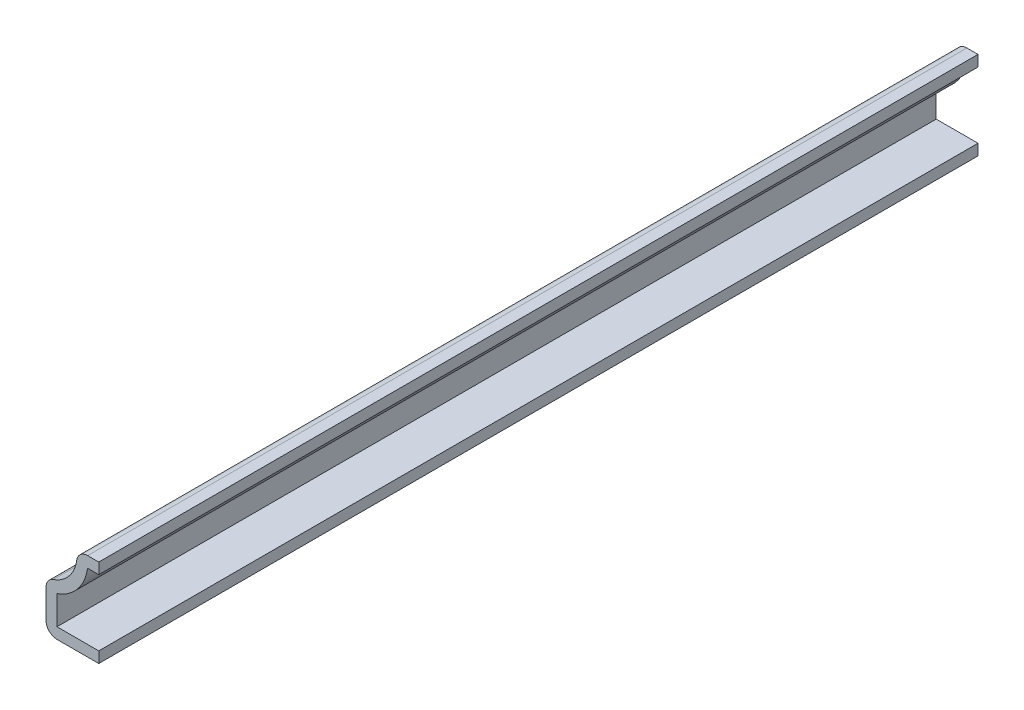
ISO-10303-21;
HEADER;
FILE_DESCRIPTION(('STEP AP214'),'2;1');
FILE_NAME('part.step','',(''),(''),'','','');
FILE_SCHEMA(('AUTOMOTIVE_DESIGN { 1 0 10303 214 1 1 1 1 }'));
ENDSEC;
DATA;
#1=APPLICATION_CONTEXT('core data for automotive mechanical design processes');
#2=APPLICATION_PROTOCOL_DEFINITION('international standard','automotive_design',2000,#1);
#3=PRODUCT_CONTEXT('',#1,'mechanical');
#4=PRODUCT('Part','Part','',(#3));
#5=PRODUCT_RELATED_PRODUCT_CATEGORY('part','',(#4));
#6=PRODUCT_DEFINITION_FORMATION('','',#4);
#7=PRODUCT_DEFINITION_CONTEXT('part definition',#1,'design');
#8=PRODUCT_DEFINITION('design','',#6,#7);
#9=PRODUCT_DEFINITION_SHAPE('','',#8);
#10=(LENGTH_UNIT() NAMED_UNIT(*) SI_UNIT(.MILLI.,.METRE.));
#11=(NAMED_UNIT(*) PLANE_ANGLE_UNIT() SI_UNIT($,.RADIAN.));
#12=(NAMED_UNIT(*) SI_UNIT($,.STERADIAN.) SOLID_ANGLE_UNIT());
#13=UNCERTAINTY_MEASURE_WITH_UNIT(LENGTH_MEASURE(1.E-05),#10,'distance_accuracy_value','');
#14=(GEOMETRIC_REPRESENTATION_CONTEXT(3) GLOBAL_UNCERTAINTY_ASSIGNED_CONTEXT((#13)) GLOBAL_UNIT_ASSIGNED_CONTEXT((#10,
#11,#12)) REPRESENTATION_CONTEXT('',''));
#15=CARTESIAN_POINT('',(0.,0.,0.));
#16=DIRECTION('',(0.,0.,1.));
#17=DIRECTION('',(1.,0.,0.));
#18=AXIS2_PLACEMENT_3D('',#15,#16,#17);
#19=CARTESIAN_POINT('',(-3.96875,13.8938,-158.75));
#20=DIRECTION('',(0.,-1.,0.));
#21=DIRECTION('',(0.,0.,-1.));
#22=AXIS2_PLACEMENT_3D('',#19,#20,#21);
#23=PLANE('',#22);
#24=DIRECTION('',(1.,0.,0.));
#25=VECTOR('',#24,1.);
#26=CARTESIAN_POINT('',(-3.96875,13.8938,0.));
#27=LINE('',#26,#25);
#28=CARTESIAN_POINT('',(-2.01113887472215,13.8938,0.));
#29=VERTEX_POINT('',#28);
#30=CARTESIAN_POINT('',(0.,13.8938,0.));
#31=VERTEX_POINT('',#30);
#32=EDGE_CURVE('E183',#29,#31,#27,.T.);
#33=ORIENTED_EDGE('',*,*,#32,.F.);
#34=DIRECTION('',(0.,0.,1.));
#35=VECTOR('',#34,1.);
#36=CARTESIAN_POINT('',(-2.01113887472215,13.8938,-158.75));
#37=LINE('',#36,#35);
#38=CARTESIAN_POINT('',(-2.01113887472215,13.8938,-158.75));
#39=VERTEX_POINT('',#38);
#40=EDGE_CURVE('E159',#39,#29,#37,.T.);
#41=ORIENTED_EDGE('',*,*,#40,.F.);
#42=DIRECTION('',(1.,0.,0.));
#43=VECTOR('',#42,1.);
#44=CARTESIAN_POINT('',(-3.96875,13.8938,-158.75));
#45=LINE('',#44,#43);
#46=CARTESIAN_POINT('',(0.,13.8938,-158.75));
#47=VERTEX_POINT('',#46);
#48=EDGE_CURVE('E141',#39,#47,#45,.T.);
#49=ORIENTED_EDGE('',*,*,#48,.T.);
#50=DIRECTION('',(0.,0.,1.));
#51=VECTOR('',#50,1.);
#52=CARTESIAN_POINT('',(0.,13.8938,-158.75));
#53=LINE('',#52,#51);
#54=EDGE_CURVE('E149',#47,#31,#53,.T.);
#55=ORIENTED_EDGE('',*,*,#54,.T.);
#56=EDGE_LOOP('',(#33,#41,#49,#55));
#57=FACE_BOUND('',#56,.T.);
#58=ADVANCED_FACE('F39',(#57),#23,.T.);
#59=CARTESIAN_POINT('',(-10.2633687388177,15.0381756857471,-158.75));
#60=DIRECTION('',(0.,0.,1.));
#61=DIRECTION('',(1.,0.,0.));
#62=AXIS2_PLACEMENT_3D('',#59,#60,#61);
#63=CYLINDRICAL_SURFACE('',#62,8.3312);
#64=CARTESIAN_POINT('',(-10.2633687388177,15.0381756857471,0.));
#65=DIRECTION('',(0.,0.,1.));
#66=DIRECTION('',(1.,0.,0.));
#67=AXIS2_PLACEMENT_3D('',#64,#65,#66);
#68=CIRCLE('',#67,8.3312);
#69=CARTESIAN_POINT('',(-7.5438,7.16335255663206,0.));
#70=VERTEX_POINT('',#69);
#71=EDGE_CURVE('E160',#70,#29,#68,.T.);
#72=ORIENTED_EDGE('',*,*,#71,.F.);
#73=DIRECTION('',(0.,0.,1.));
#74=VECTOR('',#73,1.);
#75=CARTESIAN_POINT('',(-7.5438,7.16335255663206,-158.75));
#76=LINE('',#75,#74);
#77=CARTESIAN_POINT('',(-7.5438,7.16335255663206,-158.75));
#78=VERTEX_POINT('',#77);
#79=EDGE_CURVE('E205',#78,#70,#76,.T.);
#80=ORIENTED_EDGE('',*,*,#79,.F.);
#81=CARTESIAN_POINT('',(-10.2633687388177,15.0381756857471,-158.75));
#82=DIRECTION('',(0.,0.,1.));
#83=DIRECTION('',(1.,0.,0.));
#84=AXIS2_PLACEMENT_3D('',#81,#82,#83);
#85=CIRCLE('',#84,8.3312);
#86=EDGE_CURVE('E157',#78,#39,#85,.T.);
#87=ORIENTED_EDGE('',*,*,#86,.T.);
#88=ORIENTED_EDGE('',*,*,#40,.T.);
#89=EDGE_LOOP('',(#72,#80,#87,#88));
#90=FACE_BOUND('',#89,.T.);
#91=ADVANCED_FACE('F249',(#90),#63,.T.);
#92=CARTESIAN_POINT('',(-7.5438,0.,-158.75));
#93=DIRECTION('',(1.,0.,0.));
#94=DIRECTION('',(0.,0.,-1.));
#95=AXIS2_PLACEMENT_3D('',#92,#93,#94);
#96=PLANE('',#95);
#97=DIRECTION('',(0.,1.,0.));
#98=VECTOR('',#97,1.);
#99=CARTESIAN_POINT('',(-7.5438,0.,0.));
#100=LINE('',#99,#98);
#101=CARTESIAN_POINT('',(-7.5438,1.9812,0.));
#102=VERTEX_POINT('',#101);
#103=EDGE_CURVE('E163',#102,#70,#100,.T.);
#104=ORIENTED_EDGE('',*,*,#103,.F.);
#105=DIRECTION('',(0.,0.,1.));
#106=VECTOR('',#105,1.);
#107=CARTESIAN_POINT('',(-7.5438,1.9812,-158.75));
#108=LINE('',#107,#106);
#109=CARTESIAN_POINT('',(-7.5438,1.9812,-158.75));
#110=VERTEX_POINT('',#109);
#111=EDGE_CURVE('E207',#110,#102,#108,.T.);
#112=ORIENTED_EDGE('',*,*,#111,.F.);
#113=DIRECTION('',(0.,1.,0.));
#114=VECTOR('',#113,1.);
#115=CARTESIAN_POINT('',(-7.5438,0.,-158.75));
#116=LINE('',#115,#114);
#117=EDGE_CURVE('E179',#110,#78,#116,.T.);
#118=ORIENTED_EDGE('',*,*,#117,.T.);
#119=ORIENTED_EDGE('',*,*,#79,.T.);
#120=EDGE_LOOP('',(#104,#112,#118,#119));
#121=FACE_BOUND('',#120,.T.);
#122=ADVANCED_FACE('F287',(#121),#96,.T.);
#123=CARTESIAN_POINT('',(0.,1.9812,-158.75));
#124=DIRECTION('',(0.,1.,0.));
#125=DIRECTION('',(-1.,0.,0.));
#126=AXIS2_PLACEMENT_3D('',#123,#124,#125);
#127=PLANE('',#126);
#128=DIRECTION('',(-1.,0.,0.));
#129=VECTOR('',#128,1.);
#130=CARTESIAN_POINT('',(0.,1.9812,0.));
#131=LINE('',#130,#129);
#132=CARTESIAN_POINT('',(0.,1.9812,0.));
#133=VERTEX_POINT('',#132);
#134=EDGE_CURVE('E198',#133,#102,#131,.T.);
#135=ORIENTED_EDGE('',*,*,#134,.F.);
#136=DIRECTION('',(0.,0.,1.));
#137=VECTOR('',#136,1.);
#138=CARTESIAN_POINT('',(0.,1.9812,-158.75));
#139=LINE('',#138,#137);
#140=CARTESIAN_POINT('',(0.,1.9812,-158.75));
#141=VERTEX_POINT('',#140);
#142=EDGE_CURVE('E209',#141,#133,#139,.T.);
#143=ORIENTED_EDGE('',*,*,#142,.F.);
#144=DIRECTION('',(-1.,0.,0.));
#145=VECTOR('',#144,1.);
#146=CARTESIAN_POINT('',(0.,1.9812,-158.75));
#147=LINE('',#146,#145);
#148=EDGE_CURVE('E176',#141,#110,#147,.T.);
#149=ORIENTED_EDGE('',*,*,#148,.T.);
#150=ORIENTED_EDGE('',*,*,#111,.T.);
#151=EDGE_LOOP('',(#135,#143,#149,#150));
#152=FACE_BOUND('',#151,.T.);
#153=ADVANCED_FACE('F255',(#152),#127,.T.);
#154=CARTESIAN_POINT('',(0.,1.9812,-158.75));
#155=DIRECTION('',(-1.,0.,0.));
#156=DIRECTION('',(0.,-1.,0.));
#157=AXIS2_PLACEMENT_3D('',#154,#155,#156);
#158=PLANE('',#157);
#159=DIRECTION('',(0.,-1.,0.));
#160=VECTOR('',#159,1.);
#161=CARTESIAN_POINT('',(0.,1.9812,0.));
#162=LINE('',#161,#160);
#163=CARTESIAN_POINT('',(0.,0.,0.));
#164=VERTEX_POINT('',#163);
#165=EDGE_CURVE('E196',#133,#164,#162,.T.);
#166=ORIENTED_EDGE('',*,*,#165,.T.);
#167=DIRECTION('',(0.,0.,1.));
#168=VECTOR('',#167,1.);
#169=CARTESIAN_POINT('',(0.,0.,-158.75));
#170=LINE('',#169,#168);
#171=CARTESIAN_POINT('',(0.,0.,-158.75));
#172=VERTEX_POINT('',#171);
#173=EDGE_CURVE('E211',#172,#164,#170,.T.);
#174=ORIENTED_EDGE('',*,*,#173,.F.);
#175=DIRECTION('',(0.,-1.,0.));
#176=VECTOR('',#175,1.);
#177=CARTESIAN_POINT('',(0.,1.9812,-158.75));
#178=LINE('',#177,#176);
#179=EDGE_CURVE('E174',#141,#172,#178,.T.);
#180=ORIENTED_EDGE('',*,*,#179,.F.);
#181=ORIENTED_EDGE('',*,*,#142,.T.);
#182=EDGE_LOOP('',(#166,#174,#180,#181));
#183=FACE_BOUND('',#182,.T.);
#184=ADVANCED_FACE('F260',(#183),#158,.F.);
#185=CARTESIAN_POINT('',(0.,0.,-158.75));
#186=DIRECTION('',(0.,1.,0.));
#187=DIRECTION('',(-1.,0.,0.));
#188=AXIS2_PLACEMENT_3D('',#185,#186,#187);
#189=PLANE('',#188);
#190=DIRECTION('',(-1.,0.,0.));
#191=VECTOR('',#190,1.);
#192=CARTESIAN_POINT('',(0.,0.,0.));
#193=LINE('',#192,#191);
#194=CARTESIAN_POINT('',(-7.5438,0.,0.));
#195=VERTEX_POINT('',#194);
#196=EDGE_CURVE('E193',#164,#195,#193,.T.);
#197=ORIENTED_EDGE('',*,*,#196,.T.);
#198=DIRECTION('',(0.,0.,1.));
#199=VECTOR('',#198,1.);
#200=CARTESIAN_POINT('',(-7.5438,0.,-158.75));
#201=LINE('',#200,#199);
#202=CARTESIAN_POINT('',(-7.5438,0.,-158.75));
#203=VERTEX_POINT('',#202);
#204=EDGE_CURVE('E225',#195,#203,#201,.F.);
#205=ORIENTED_EDGE('',*,*,#204,.T.);
#206=DIRECTION('',(-1.,0.,0.));
#207=VECTOR('',#206,1.);
#208=CARTESIAN_POINT('',(0.,0.,-158.75));
#209=LINE('',#208,#207);
#210=EDGE_CURVE('E172',#172,#203,#209,.T.);
#211=ORIENTED_EDGE('',*,*,#210,.F.);
#212=ORIENTED_EDGE('',*,*,#173,.T.);
#213=EDGE_LOOP('',(#197,#205,#211,#212));
#214=FACE_BOUND('',#213,.T.);
#215=ADVANCED_FACE('F273',(#214),#189,.F.);
#216=CARTESIAN_POINT('',(-9.525,0.,-158.75));
#217=DIRECTION('',(1.,0.,0.));
#218=DIRECTION('',(0.,0.,-1.));
#219=AXIS2_PLACEMENT_3D('',#216,#217,#218);
#220=PLANE('',#219);
#221=DIRECTION('',(0.,1.,0.));
#222=VECTOR('',#221,1.);
#223=CARTESIAN_POINT('',(-9.525,0.,-158.75));
#224=LINE('',#223,#222);
#225=CARTESIAN_POINT('',(-9.525,1.9812,-158.75));
#226=VERTEX_POINT('',#225);
#227=CARTESIAN_POINT('',(-9.525,7.16335255663206,-158.75));
#228=VERTEX_POINT('',#227);
#229=EDGE_CURVE('E169',#226,#228,#224,.T.);
#230=ORIENTED_EDGE('',*,*,#229,.F.);
#231=DIRECTION('',(0.,0.,1.));
#232=VECTOR('',#231,1.);
#233=CARTESIAN_POINT('',(-9.525,1.9812,-158.75));
#234=LINE('',#233,#232);
#235=CARTESIAN_POINT('',(-9.525,1.9812,0.));
#236=VERTEX_POINT('',#235);
#237=EDGE_CURVE('E216',#226,#236,#234,.T.);
#238=ORIENTED_EDGE('',*,*,#237,.T.);
#239=DIRECTION('',(0.,1.,0.));
#240=VECTOR('',#239,1.);
#241=CARTESIAN_POINT('',(-9.525,0.,0.));
#242=LINE('',#241,#240);
#243=CARTESIAN_POINT('',(-9.525,7.16335255663206,0.));
#244=VERTEX_POINT('',#243);
#245=EDGE_CURVE('E190',#236,#244,#242,.T.);
#246=ORIENTED_EDGE('',*,*,#245,.T.);
#247=DIRECTION('',(0.,0.,1.));
#248=VECTOR('',#247,1.);
#249=CARTESIAN_POINT('',(-9.525,7.16335255663206,-158.75));
#250=LINE('',#249,#248);
#251=EDGE_CURVE('E204',#244,#228,#250,.F.);
#252=ORIENTED_EDGE('',*,*,#251,.T.);
#253=EDGE_LOOP('',(#230,#238,#246,#252));
#254=FACE_BOUND('',#253,.T.);
#255=ADVANCED_FACE('F270',(#254),#220,.F.);
#256=CARTESIAN_POINT('',(-10.2633687388177,15.0381756857471,-158.75));
#257=DIRECTION('',(0.,0.,1.));
#258=DIRECTION('',(1.,0.,0.));
#259=AXIS2_PLACEMENT_3D('',#256,#257,#258);
#260=CYLINDRICAL_SURFACE('',#259,6.35);
#261=CARTESIAN_POINT('',(-10.2633687388177,15.0381756857471,-158.75));
#262=DIRECTION('',(0.,0.,1.));
#263=DIRECTION('',(1.,0.,0.));
#264=AXIS2_PLACEMENT_3D('',#261,#262,#263);
#265=CIRCLE('',#264,6.35);
#266=CARTESIAN_POINT('',(-8.19052671227982,9.03602391050698,-158.75));
#267=VERTEX_POINT('',#266);
#268=CARTESIAN_POINT('',(-3.9735593911839,14.1659381203911,-158.75));
#269=VERTEX_POINT('',#268);
#270=EDGE_CURVE('E167',#267,#269,#265,.T.);
#271=ORIENTED_EDGE('',*,*,#270,.F.);
#272=DIRECTION('',(0.,0.,1.));
#273=VECTOR('',#272,1.);
#274=CARTESIAN_POINT('',(-8.19052671227982,9.03602391050698,-158.75));
#275=LINE('',#274,#273);
#276=CARTESIAN_POINT('',(-8.19052671227982,9.03602391050698,0.));
#277=VERTEX_POINT('',#276);
#278=EDGE_CURVE('E47',#267,#277,#275,.T.);
#279=ORIENTED_EDGE('',*,*,#278,.T.);
#280=CARTESIAN_POINT('',(-10.2633687388177,15.0381756857471,0.));
#281=DIRECTION('',(0.,0.,1.));
#282=DIRECTION('',(1.,0.,0.));
#283=AXIS2_PLACEMENT_3D('',#280,#281,#282);
#284=CIRCLE('',#283,6.35);
#285=CARTESIAN_POINT('',(-3.9735593911839,14.1659381203911,0.));
#286=VERTEX_POINT('',#285);
#287=EDGE_CURVE('E188',#277,#286,#284,.T.);
#288=ORIENTED_EDGE('',*,*,#287,.T.);
#289=DIRECTION('',(0.,0.,1.));
#290=VECTOR('',#289,1.);
#291=CARTESIAN_POINT('',(-3.9735593911839,14.1659381203911,-158.75));
#292=LINE('',#291,#290);
#293=EDGE_CURVE('E62',#286,#269,#292,.F.);
#294=ORIENTED_EDGE('',*,*,#293,.T.);
#295=EDGE_LOOP('',(#271,#279,#288,#294));
#296=FACE_BOUND('',#295,.T.);
#297=ADVANCED_FACE('F235',(#296),#260,.F.);
#298=CARTESIAN_POINT('',(-3.96875,15.875,-158.75));
#299=DIRECTION('',(0.,-1.,0.));
#300=DIRECTION('',(0.,0.,-1.));
#301=AXIS2_PLACEMENT_3D('',#298,#299,#300);
#302=PLANE('',#301);
#303=DIRECTION('',(1.,0.,0.));
#304=VECTOR('',#303,1.);
#305=CARTESIAN_POINT('',(-3.96875,15.875,-158.75));
#306=LINE('',#305,#304);
#307=CARTESIAN_POINT('',(-2.01113887472215,15.875,-158.75));
#308=VERTEX_POINT('',#307);
#309=CARTESIAN_POINT('',(0.,15.875,-158.75));
#310=VERTEX_POINT('',#309);
#311=EDGE_CURVE('E143',#308,#310,#306,.T.);
#312=ORIENTED_EDGE('',*,*,#311,.F.);
#313=DIRECTION('',(0.,0.,1.));
#314=VECTOR('',#313,1.);
#315=CARTESIAN_POINT('',(-2.01113887472215,15.875,-158.75));
#316=LINE('',#315,#314);
#317=CARTESIAN_POINT('',(-2.01113887472215,15.875,0.));
#318=VERTEX_POINT('',#317);
#319=EDGE_CURVE('E11',#308,#318,#316,.T.);
#320=ORIENTED_EDGE('',*,*,#319,.T.);
#321=DIRECTION('',(1.,0.,0.));
#322=VECTOR('',#321,1.);
#323=CARTESIAN_POINT('',(-3.96875,15.875,0.));
#324=LINE('',#323,#322);
#325=CARTESIAN_POINT('',(0.,15.875,0.));
#326=VERTEX_POINT('',#325);
#327=EDGE_CURVE('E186',#318,#326,#324,.T.);
#328=ORIENTED_EDGE('',*,*,#327,.T.);
#329=DIRECTION('',(0.,0.,1.));
#330=VECTOR('',#329,1.);
#331=CARTESIAN_POINT('',(0.,15.875,-158.75));
#332=LINE('',#331,#330);
#333=EDGE_CURVE('E156',#310,#326,#332,.T.);
#334=ORIENTED_EDGE('',*,*,#333,.F.);
#335=EDGE_LOOP('',(#312,#320,#328,#334));
#336=FACE_BOUND('',#335,.T.);
#337=ADVANCED_FACE('F245',(#336),#302,.F.);
#338=CARTESIAN_POINT('',(0.,15.875,-158.75));
#339=DIRECTION('',(-1.,0.,0.));
#340=DIRECTION('',(0.,0.,1.));
#341=AXIS2_PLACEMENT_3D('',#338,#339,#340);
#342=PLANE('',#341);
#343=DIRECTION('',(0.,-1.,0.));
#344=VECTOR('',#343,1.);
#345=CARTESIAN_POINT('',(0.,15.875,0.));
#346=LINE('',#345,#344);
#347=EDGE_CURVE('E152',#326,#31,#346,.T.);
#348=ORIENTED_EDGE('',*,*,#347,.T.);
#349=ORIENTED_EDGE('',*,*,#54,.F.);
#350=DIRECTION('',(0.,-1.,0.));
#351=VECTOR('',#350,1.);
#352=CARTESIAN_POINT('',(0.,15.875,-158.75));
#353=LINE('',#352,#351);
#354=EDGE_CURVE('E135',#310,#47,#353,.T.);
#355=ORIENTED_EDGE('',*,*,#354,.F.);
#356=ORIENTED_EDGE('',*,*,#333,.T.);
#357=EDGE_LOOP('',(#348,#349,#355,#356));
#358=FACE_BOUND('',#357,.T.);
#359=ADVANCED_FACE('F150',(#358),#342,.F.);
#360=CARTESIAN_POINT('',(-10.2633687388177,15.0381756857471,-158.75));
#361=DIRECTION('',(0.,0.,1.));
#362=DIRECTION('',(1.,0.,0.));
#363=AXIS2_PLACEMENT_3D('',#360,#361,#362);
#364=PLANE('',#363);
#365=ORIENTED_EDGE('',*,*,#210,.T.);
#366=CARTESIAN_POINT('',(-7.5438,1.9812,-158.75));
#367=DIRECTION('',(0.,0.,1.));
#368=DIRECTION('',(1.,0.,0.));
#369=AXIS2_PLACEMENT_3D('',#366,#367,#368);
#370=CIRCLE('',#369,1.9812);
#371=EDGE_CURVE('E230',#203,#226,#370,.F.);
#372=ORIENTED_EDGE('',*,*,#371,.T.);
#373=ORIENTED_EDGE('',*,*,#229,.T.);
#374=CARTESIAN_POINT('',(-7.5438,7.16335255663206,-158.75));
#375=DIRECTION('',(0.,0.,1.));
#376=DIRECTION('',(1.,0.,0.));
#377=AXIS2_PLACEMENT_3D('',#374,#375,#376);
#378=CIRCLE('',#377,1.9812);
#379=EDGE_CURVE('E228',#228,#267,#378,.F.);
#380=ORIENTED_EDGE('',*,*,#379,.T.);
#381=ORIENTED_EDGE('',*,*,#270,.T.);
#382=CARTESIAN_POINT('',(-2.01113887472215,13.8938,-158.75));
#383=DIRECTION('',(0.,0.,1.));
#384=DIRECTION('',(1.,0.,0.));
#385=AXIS2_PLACEMENT_3D('',#382,#383,#384);
#386=CIRCLE('',#385,1.9812);
#387=EDGE_CURVE('E54',#269,#308,#386,.F.);
#388=ORIENTED_EDGE('',*,*,#387,.T.);
#389=ORIENTED_EDGE('',*,*,#311,.T.);
#390=ORIENTED_EDGE('',*,*,#354,.T.);
#391=ORIENTED_EDGE('',*,*,#48,.F.);
#392=ORIENTED_EDGE('',*,*,#86,.F.);
#393=ORIENTED_EDGE('',*,*,#117,.F.);
#394=ORIENTED_EDGE('',*,*,#148,.F.);
#395=ORIENTED_EDGE('',*,*,#179,.T.);
#396=EDGE_LOOP('',(#365,#372,#373,#380,#381,#388,#389,#390,#391,#392,#393,#394,#395));
#397=FACE_BOUND('',#396,.T.);
#398=ADVANCED_FACE('F138',(#397),#364,.F.);
#399=CARTESIAN_POINT('',(-10.2633687388177,15.0381756857471,0.));
#400=DIRECTION('',(0.,0.,1.));
#401=DIRECTION('',(1.,0.,0.));
#402=AXIS2_PLACEMENT_3D('',#399,#400,#401);
#403=PLANE('',#402);
#404=ORIENTED_EDGE('',*,*,#245,.F.);
#405=CARTESIAN_POINT('',(-7.5438,1.9812,0.));
#406=DIRECTION('',(0.,0.,1.));
#407=DIRECTION('',(1.,0.,0.));
#408=AXIS2_PLACEMENT_3D('',#405,#406,#407);
#409=CIRCLE('',#408,1.9812);
#410=EDGE_CURVE('E223',#236,#195,#409,.T.);
#411=ORIENTED_EDGE('',*,*,#410,.T.);
#412=ORIENTED_EDGE('',*,*,#196,.F.);
#413=ORIENTED_EDGE('',*,*,#165,.F.);
#414=ORIENTED_EDGE('',*,*,#134,.T.);
#415=ORIENTED_EDGE('',*,*,#103,.T.);
#416=ORIENTED_EDGE('',*,*,#71,.T.);
#417=ORIENTED_EDGE('',*,*,#32,.T.);
#418=ORIENTED_EDGE('',*,*,#347,.F.);
#419=ORIENTED_EDGE('',*,*,#327,.F.);
#420=CARTESIAN_POINT('',(-2.01113887472215,13.8938,0.));
#421=DIRECTION('',(0.,0.,1.));
#422=DIRECTION('',(1.,0.,0.));
#423=AXIS2_PLACEMENT_3D('',#420,#421,#422);
#424=CIRCLE('',#423,1.9812);
#425=EDGE_CURVE('E219',#318,#286,#424,.T.);
#426=ORIENTED_EDGE('',*,*,#425,.T.);
#427=ORIENTED_EDGE('',*,*,#287,.F.);
#428=CARTESIAN_POINT('',(-7.5438,7.16335255663206,0.));
#429=DIRECTION('',(0.,0.,1.));
#430=DIRECTION('',(1.,0.,0.));
#431=AXIS2_PLACEMENT_3D('',#428,#429,#430);
#432=CIRCLE('',#431,1.9812);
#433=EDGE_CURVE('E221',#277,#244,#432,.T.);
#434=ORIENTED_EDGE('',*,*,#433,.T.);
#435=EDGE_LOOP('',(#404,#411,#412,#413,#414,#415,#416,#417,#418,#419,#426,#427,#434));
#436=FACE_BOUND('',#435,.T.);
#437=ADVANCED_FACE('F240',(#436),#403,.T.);
#438=CARTESIAN_POINT('',(-7.5438,1.9812,-158.75));
#439=DIRECTION('',(0.,0.,1.));
#440=DIRECTION('',(1.,0.,0.));
#441=AXIS2_PLACEMENT_3D('',#438,#439,#440);
#442=CYLINDRICAL_SURFACE('',#441,1.9812);
#443=ORIENTED_EDGE('',*,*,#371,.F.);
#444=ORIENTED_EDGE('',*,*,#204,.F.);
#445=ORIENTED_EDGE('',*,*,#410,.F.);
#446=ORIENTED_EDGE('',*,*,#237,.F.);
#447=EDGE_LOOP('',(#443,#444,#445,#446));
#448=FACE_BOUND('',#447,.T.);
#449=ADVANCED_FACE('F268',(#448),#442,.T.);
#450=CARTESIAN_POINT('',(-7.5438,7.16335255663206,-158.75));
#451=DIRECTION('',(0.,0.,1.));
#452=DIRECTION('',(1.,0.,0.));
#453=AXIS2_PLACEMENT_3D('',#450,#451,#452);
#454=CYLINDRICAL_SURFACE('',#453,1.9812);
#455=ORIENTED_EDGE('',*,*,#379,.F.);
#456=ORIENTED_EDGE('',*,*,#251,.F.);
#457=ORIENTED_EDGE('',*,*,#433,.F.);
#458=ORIENTED_EDGE('',*,*,#278,.F.);
#459=EDGE_LOOP('',(#455,#456,#457,#458));
#460=FACE_BOUND('',#459,.T.);
#461=ADVANCED_FACE('F293',(#460),#454,.T.);
#462=CARTESIAN_POINT('',(-2.01113887472215,13.8938,-158.75));
#463=DIRECTION('',(0.,0.,1.));
#464=DIRECTION('',(1.,0.,0.));
#465=AXIS2_PLACEMENT_3D('',#462,#463,#464);
#466=CYLINDRICAL_SURFACE('',#465,1.9812);
#467=ORIENTED_EDGE('',*,*,#387,.F.);
#468=ORIENTED_EDGE('',*,*,#293,.F.);
#469=ORIENTED_EDGE('',*,*,#425,.F.);
#470=ORIENTED_EDGE('',*,*,#319,.F.);
#471=EDGE_LOOP('',(#467,#468,#469,#470));
#472=FACE_BOUND('',#471,.T.);
#473=ADVANCED_FACE('F41',(#472),#466,.T.);
#474=CLOSED_SHELL('',(#58,#91,#122,#153,#184,#215,#255,#297,#337,#359,#398,#437,#449,#461,#473));
#475=MANIFOLD_SOLID_BREP('B2',#474);
#476=ADVANCED_BREP_SHAPE_REPRESENTATION('',(#18,#475),#14);
#477=SHAPE_DEFINITION_REPRESENTATION(#9,#476);
ENDSEC;
END-ISO-10303-21;
